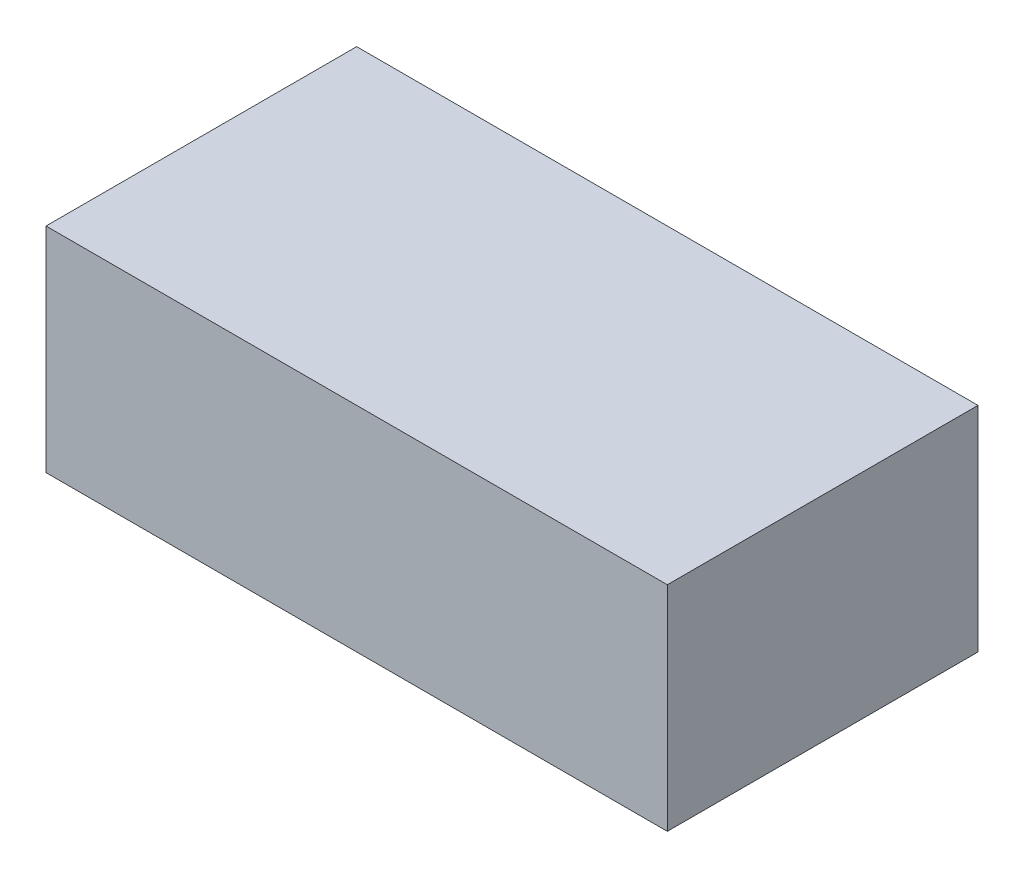
ISO-10303-21;
HEADER;
FILE_DESCRIPTION(('STEP AP214'),'2;1');
FILE_NAME('part.step','',(''),(''),'','','');
FILE_SCHEMA(('AUTOMOTIVE_DESIGN { 1 0 10303 214 1 1 1 1 }'));
ENDSEC;
DATA;
#1=APPLICATION_CONTEXT('core data for automotive mechanical design processes');
#2=APPLICATION_PROTOCOL_DEFINITION('international standard','automotive_design',2000,#1);
#3=PRODUCT_CONTEXT('',#1,'mechanical');
#4=PRODUCT('Part','Part','',(#3));
#5=PRODUCT_RELATED_PRODUCT_CATEGORY('part','',(#4));
#6=PRODUCT_DEFINITION_FORMATION('','',#4);
#7=PRODUCT_DEFINITION_CONTEXT('part definition',#1,'design');
#8=PRODUCT_DEFINITION('design','',#6,#7);
#9=PRODUCT_DEFINITION_SHAPE('','',#8);
#10=(LENGTH_UNIT() NAMED_UNIT(*) SI_UNIT(.MILLI.,.METRE.));
#11=(NAMED_UNIT(*) PLANE_ANGLE_UNIT() SI_UNIT($,.RADIAN.));
#12=(NAMED_UNIT(*) SI_UNIT($,.STERADIAN.) SOLID_ANGLE_UNIT());
#13=UNCERTAINTY_MEASURE_WITH_UNIT(LENGTH_MEASURE(1.E-05),#10,'distance_accuracy_value','');
#14=(GEOMETRIC_REPRESENTATION_CONTEXT(3) GLOBAL_UNCERTAINTY_ASSIGNED_CONTEXT((#13)) GLOBAL_UNIT_ASSIGNED_CONTEXT((#10,
#11,#12)) REPRESENTATION_CONTEXT('',''));
#15=CARTESIAN_POINT('',(0.,0.,0.));
#16=DIRECTION('',(0.,0.,1.));
#17=DIRECTION('',(1.,0.,0.));
#18=AXIS2_PLACEMENT_3D('',#15,#16,#17);
#19=CARTESIAN_POINT('',(0.8,0.55,-0.4));
#20=DIRECTION('',(-1.,0.,0.));
#21=DIRECTION('',(0.,0.,1.));
#22=AXIS2_PLACEMENT_3D('',#19,#20,#21);
#23=PLANE('',#22);
#24=DIRECTION('',(0.,0.,-1.));
#25=VECTOR('',#24,1.);
#26=CARTESIAN_POINT('',(0.8,0.,-0.4));
#27=LINE('',#26,#25);
#28=CARTESIAN_POINT('',(0.8,0.,0.4));
#29=VERTEX_POINT('',#28);
#30=CARTESIAN_POINT('',(0.8,0.,-0.4));
#31=VERTEX_POINT('',#30);
#32=EDGE_CURVE('E99',#29,#31,#27,.T.);
#33=ORIENTED_EDGE('',*,*,#32,.T.);
#34=DIRECTION('',(0.,-1.,0.));
#35=VECTOR('',#34,1.);
#36=CARTESIAN_POINT('',(0.8,0.55,-0.4));
#37=LINE('',#36,#35);
#38=CARTESIAN_POINT('',(0.8,0.55,-0.4));
#39=VERTEX_POINT('',#38);
#40=EDGE_CURVE('E11',#39,#31,#37,.T.);
#41=ORIENTED_EDGE('',*,*,#40,.F.);
#42=DIRECTION('',(0.,0.,-1.));
#43=VECTOR('',#42,1.);
#44=CARTESIAN_POINT('',(0.8,0.55,-0.4));
#45=LINE('',#44,#43);
#46=CARTESIAN_POINT('',(0.8,0.55,0.4));
#47=VERTEX_POINT('',#46);
#48=EDGE_CURVE('E87',#47,#39,#45,.T.);
#49=ORIENTED_EDGE('',*,*,#48,.F.);
#50=DIRECTION('',(0.,-1.,0.));
#51=VECTOR('',#50,1.);
#52=CARTESIAN_POINT('',(0.8,0.55,0.4));
#53=LINE('',#52,#51);
#54=EDGE_CURVE('E95',#47,#29,#53,.T.);
#55=ORIENTED_EDGE('',*,*,#54,.T.);
#56=EDGE_LOOP('',(#33,#41,#49,#55));
#57=FACE_BOUND('',#56,.T.);
#58=ADVANCED_FACE('F36',(#57),#23,.F.);
#59=CARTESIAN_POINT('',(-0.8,0.55,-0.4));
#60=DIRECTION('',(0.,0.,1.));
#61=DIRECTION('',(1.,0.,0.));
#62=AXIS2_PLACEMENT_3D('',#59,#60,#61);
#63=PLANE('',#62);
#64=DIRECTION('',(-1.,0.,0.));
#65=VECTOR('',#64,1.);
#66=CARTESIAN_POINT('',(-0.8,0.,-0.4));
#67=LINE('',#66,#65);
#68=CARTESIAN_POINT('',(-0.8,0.,-0.4));
#69=VERTEX_POINT('',#68);
#70=EDGE_CURVE('E91',#31,#69,#67,.T.);
#71=ORIENTED_EDGE('',*,*,#70,.T.);
#72=DIRECTION('',(0.,-1.,0.));
#73=VECTOR('',#72,1.);
#74=CARTESIAN_POINT('',(-0.8,0.55,-0.4));
#75=LINE('',#74,#73);
#76=CARTESIAN_POINT('',(-0.8,0.55,-0.4));
#77=VERTEX_POINT('',#76);
#78=EDGE_CURVE('E44',#77,#69,#75,.T.);
#79=ORIENTED_EDGE('',*,*,#78,.F.);
#80=DIRECTION('',(-1.,0.,0.));
#81=VECTOR('',#80,1.);
#82=CARTESIAN_POINT('',(-0.8,0.55,-0.4));
#83=LINE('',#82,#81);
#84=EDGE_CURVE('E82',#39,#77,#83,.T.);
#85=ORIENTED_EDGE('',*,*,#84,.F.);
#86=ORIENTED_EDGE('',*,*,#40,.T.);
#87=EDGE_LOOP('',(#71,#79,#85,#86));
#88=FACE_BOUND('',#87,.T.);
#89=ADVANCED_FACE('F90',(#88),#63,.F.);
#90=CARTESIAN_POINT('',(-0.8,0.55,-0.4));
#91=DIRECTION('',(1.,0.,0.));
#92=DIRECTION('',(0.,0.,-1.));
#93=AXIS2_PLACEMENT_3D('',#90,#91,#92);
#94=PLANE('',#93);
#95=DIRECTION('',(0.,0.,1.));
#96=VECTOR('',#95,1.);
#97=CARTESIAN_POINT('',(-0.8,0.,-0.4));
#98=LINE('',#97,#96);
#99=CARTESIAN_POINT('',(-0.8,0.,0.4));
#100=VERTEX_POINT('',#99);
#101=EDGE_CURVE('E69',#69,#100,#98,.T.);
#102=ORIENTED_EDGE('',*,*,#101,.T.);
#103=DIRECTION('',(0.,-1.,0.));
#104=VECTOR('',#103,1.);
#105=CARTESIAN_POINT('',(-0.8,0.55,0.4));
#106=LINE('',#105,#104);
#107=CARTESIAN_POINT('',(-0.8,0.55,0.4));
#108=VERTEX_POINT('',#107);
#109=EDGE_CURVE('E92',#108,#100,#106,.T.);
#110=ORIENTED_EDGE('',*,*,#109,.F.);
#111=DIRECTION('',(0.,0.,1.));
#112=VECTOR('',#111,1.);
#113=CARTESIAN_POINT('',(-0.8,0.55,-0.4));
#114=LINE('',#113,#112);
#115=EDGE_CURVE('E85',#77,#108,#114,.T.);
#116=ORIENTED_EDGE('',*,*,#115,.F.);
#117=ORIENTED_EDGE('',*,*,#78,.T.);
#118=EDGE_LOOP('',(#102,#110,#116,#117));
#119=FACE_BOUND('',#118,.T.);
#120=ADVANCED_FACE('F93',(#119),#94,.F.);
#121=CARTESIAN_POINT('',(-0.8,0.55,0.4));
#122=DIRECTION('',(0.,0.,-1.));
#123=DIRECTION('',(-1.,0.,0.));
#124=AXIS2_PLACEMENT_3D('',#121,#122,#123);
#125=PLANE('',#124);
#126=DIRECTION('',(1.,0.,0.));
#127=VECTOR('',#126,1.);
#128=CARTESIAN_POINT('',(-0.8,0.,0.4));
#129=LINE('',#128,#127);
#130=EDGE_CURVE('E75',#100,#29,#129,.T.);
#131=ORIENTED_EDGE('',*,*,#130,.T.);
#132=ORIENTED_EDGE('',*,*,#54,.F.);
#133=DIRECTION('',(1.,0.,0.));
#134=VECTOR('',#133,1.);
#135=CARTESIAN_POINT('',(-0.8,0.55,0.4));
#136=LINE('',#135,#134);
#137=EDGE_CURVE('E52',#108,#47,#136,.T.);
#138=ORIENTED_EDGE('',*,*,#137,.F.);
#139=ORIENTED_EDGE('',*,*,#109,.T.);
#140=EDGE_LOOP('',(#131,#132,#138,#139));
#141=FACE_BOUND('',#140,.T.);
#142=ADVANCED_FACE('F106',(#141),#125,.F.);
#143=CARTESIAN_POINT('',(0.,0.55,0.));
#144=DIRECTION('',(0.,1.,0.));
#145=DIRECTION('',(0.,0.,1.));
#146=AXIS2_PLACEMENT_3D('',#143,#144,#145);
#147=PLANE('',#146);
#148=ORIENTED_EDGE('',*,*,#48,.T.);
#149=ORIENTED_EDGE('',*,*,#84,.T.);
#150=ORIENTED_EDGE('',*,*,#115,.T.);
#151=ORIENTED_EDGE('',*,*,#137,.T.);
#152=EDGE_LOOP('',(#148,#149,#150,#151));
#153=FACE_BOUND('',#152,.T.);
#154=ADVANCED_FACE('F83',(#153),#147,.T.);
#155=CARTESIAN_POINT('',(0.,0.,0.));
#156=DIRECTION('',(0.,1.,0.));
#157=DIRECTION('',(0.,0.,1.));
#158=AXIS2_PLACEMENT_3D('',#155,#156,#157);
#159=PLANE('',#158);
#160=ORIENTED_EDGE('',*,*,#32,.F.);
#161=ORIENTED_EDGE('',*,*,#130,.F.);
#162=ORIENTED_EDGE('',*,*,#101,.F.);
#163=ORIENTED_EDGE('',*,*,#70,.F.);
#164=EDGE_LOOP('',(#160,#161,#162,#163));
#165=FACE_BOUND('',#164,.T.);
#166=ADVANCED_FACE('F109',(#165),#159,.F.);
#167=CLOSED_SHELL('',(#58,#89,#120,#142,#154,#166));
#168=MANIFOLD_SOLID_BREP('B2',#167);
#169=ADVANCED_BREP_SHAPE_REPRESENTATION('',(#18,#168),#14);
#170=SHAPE_DEFINITION_REPRESENTATION(#9,#169);
ENDSEC;
END-ISO-10303-21;
